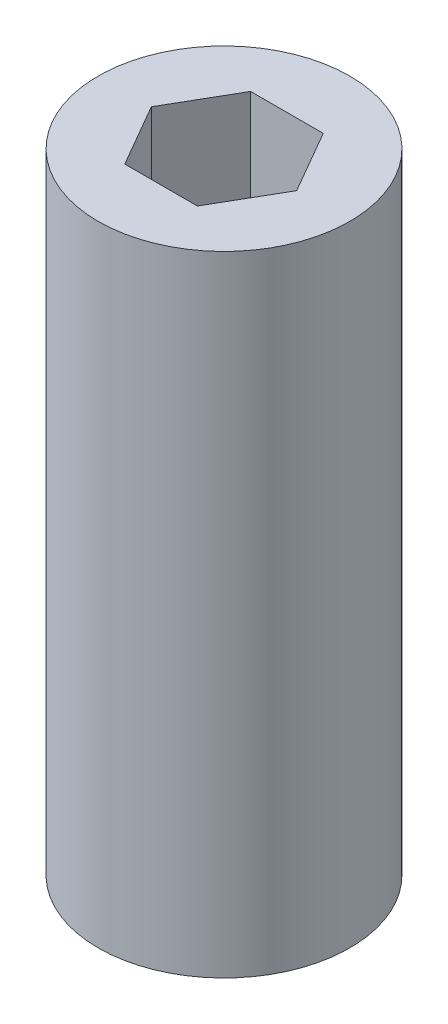
ISO-10303-21;
HEADER;
FILE_DESCRIPTION(('STEP AP214'),'2;1');
FILE_NAME('part.step','',(''),(''),'','','');
FILE_SCHEMA(('AUTOMOTIVE_DESIGN { 1 0 10303 214 1 1 1 1 }'));
ENDSEC;
DATA;
#1=APPLICATION_CONTEXT('core data for automotive mechanical design processes');
#2=APPLICATION_PROTOCOL_DEFINITION('international standard','automotive_design',2000,#1);
#3=PRODUCT_CONTEXT('',#1,'mechanical');
#4=PRODUCT('Part','Part','',(#3));
#5=PRODUCT_RELATED_PRODUCT_CATEGORY('part','',(#4));
#6=PRODUCT_DEFINITION_FORMATION('','',#4);
#7=PRODUCT_DEFINITION_CONTEXT('part definition',#1,'design');
#8=PRODUCT_DEFINITION('design','',#6,#7);
#9=PRODUCT_DEFINITION_SHAPE('','',#8);
#10=(LENGTH_UNIT() NAMED_UNIT(*) SI_UNIT(.MILLI.,.METRE.));
#11=(NAMED_UNIT(*) PLANE_ANGLE_UNIT() SI_UNIT($,.RADIAN.));
#12=(NAMED_UNIT(*) SI_UNIT($,.STERADIAN.) SOLID_ANGLE_UNIT());
#13=UNCERTAINTY_MEASURE_WITH_UNIT(LENGTH_MEASURE(1.E-05),#10,'distance_accuracy_value','');
#14=(GEOMETRIC_REPRESENTATION_CONTEXT(3) GLOBAL_UNCERTAINTY_ASSIGNED_CONTEXT((#13)) GLOBAL_UNIT_ASSIGNED_CONTEXT((#10,
#11,#12)) REPRESENTATION_CONTEXT('',''));
#15=CARTESIAN_POINT('',(0.,0.,0.));
#16=DIRECTION('',(0.,0.,1.));
#17=DIRECTION('',(1.,0.,0.));
#18=AXIS2_PLACEMENT_3D('',#15,#16,#17);
#19=CARTESIAN_POINT('',(0.,8.3,7.));
#20=DIRECTION('',(0.,1.,0.));
#21=DIRECTION('',(0.,0.,1.));
#22=AXIS2_PLACEMENT_3D('',#19,#20,#21);
#23=PLANE('',#22);
#24=DIRECTION('',(-0.49999999836129,0.,-0.866025404730548));
#25=VECTOR('',#24,1.);
#26=CARTESIAN_POINT('',(0.64951905,8.3,6.625));
#27=LINE('',#26,#25);
#28=CARTESIAN_POINT('',(0.8660254,8.3,7.));
#29=VERTEX_POINT('',#28);
#30=CARTESIAN_POINT('',(0.4330127,8.3,6.25));
#31=VERTEX_POINT('',#30);
#32=EDGE_CURVE('E80',#29,#31,#27,.T.);
#33=ORIENTED_EDGE('',*,*,#32,.T.);
#34=DIRECTION('',(-1.,0.,0.));
#35=VECTOR('',#34,1.);
#36=CARTESIAN_POINT('',(0.,8.3,6.25));
#37=LINE('',#36,#35);
#38=CARTESIAN_POINT('',(-0.4330127,8.3,6.25));
#39=VERTEX_POINT('',#38);
#40=EDGE_CURVE('E64',#31,#39,#37,.T.);
#41=ORIENTED_EDGE('',*,*,#40,.T.);
#42=DIRECTION('',(-0.49999999836129,0.,0.866025404730548));
#43=VECTOR('',#42,1.);
#44=CARTESIAN_POINT('',(-0.64951905,8.3,6.625));
#45=LINE('',#44,#43);
#46=CARTESIAN_POINT('',(-0.8660254,8.3,7.));
#47=VERTEX_POINT('',#46);
#48=EDGE_CURVE('E69',#39,#47,#45,.T.);
#49=ORIENTED_EDGE('',*,*,#48,.T.);
#50=DIRECTION('',(0.49999999836129,0.,0.866025404730548));
#51=VECTOR('',#50,1.);
#52=CARTESIAN_POINT('',(-0.64951905,8.3,7.375));
#53=LINE('',#52,#51);
#54=CARTESIAN_POINT('',(-0.4330127,8.3,7.75));
#55=VERTEX_POINT('',#54);
#56=EDGE_CURVE('E103',#47,#55,#53,.T.);
#57=ORIENTED_EDGE('',*,*,#56,.T.);
#58=DIRECTION('',(1.,0.,0.));
#59=VECTOR('',#58,1.);
#60=CARTESIAN_POINT('',(0.,8.3,7.75));
#61=LINE('',#60,#59);
#62=CARTESIAN_POINT('',(0.4330127,8.3,7.75));
#63=VERTEX_POINT('',#62);
#64=EDGE_CURVE('E98',#55,#63,#61,.T.);
#65=ORIENTED_EDGE('',*,*,#64,.T.);
#66=DIRECTION('',(0.49999999836129,0.,-0.866025404730548));
#67=VECTOR('',#66,1.);
#68=CARTESIAN_POINT('',(0.64951905,8.3,7.375));
#69=LINE('',#68,#67);
#70=EDGE_CURVE('E94',#63,#29,#69,.T.);
#71=ORIENTED_EDGE('',*,*,#70,.T.);
#72=EDGE_LOOP('',(#33,#41,#49,#57,#65,#71));
#73=FACE_BOUND('',#72,.T.);
#74=ADVANCED_FACE('F16',(#73),#23,.T.);
#75=CARTESIAN_POINT('',(-0.64951905,10.,6.625));
#76=DIRECTION('',(-0.866025404730548,0.,-0.49999999836129));
#77=DIRECTION('',(-0.49999999836129,0.,0.866025404730548));
#78=AXIS2_PLACEMENT_3D('',#75,#76,#77);
#79=PLANE('',#78);
#80=DIRECTION('',(0.,1.,0.));
#81=VECTOR('',#80,1.);
#82=CARTESIAN_POINT('',(-0.4330127,10.,6.25));
#83=LINE('',#82,#81);
#84=CARTESIAN_POINT('',(-0.4330127,10.,6.25));
#85=VERTEX_POINT('',#84);
#86=EDGE_CURVE('E71',#39,#85,#83,.T.);
#87=ORIENTED_EDGE('',*,*,#86,.T.);
#88=DIRECTION('',(0.49999999836129,0.,-0.866025404730548));
#89=VECTOR('',#88,1.);
#90=CARTESIAN_POINT('',(-0.8660254,10.,7.));
#91=LINE('',#90,#89);
#92=CARTESIAN_POINT('',(-0.8660254,10.,7.));
#93=VERTEX_POINT('',#92);
#94=EDGE_CURVE('E105',#93,#85,#91,.T.);
#95=ORIENTED_EDGE('',*,*,#94,.F.);
#96=DIRECTION('',(0.,1.,0.));
#97=VECTOR('',#96,1.);
#98=CARTESIAN_POINT('',(-0.8660254,10.,7.));
#99=LINE('',#98,#97);
#100=EDGE_CURVE('E74',#93,#47,#99,.F.);
#101=ORIENTED_EDGE('',*,*,#100,.T.);
#102=ORIENTED_EDGE('',*,*,#48,.F.);
#103=EDGE_LOOP('',(#87,#95,#101,#102));
#104=FACE_BOUND('',#103,.T.);
#105=ADVANCED_FACE('F70',(#104),#79,.F.);
#106=CARTESIAN_POINT('',(0.,10.,6.25));
#107=DIRECTION('',(0.,0.,-1.));
#108=DIRECTION('',(-1.,0.,0.));
#109=AXIS2_PLACEMENT_3D('',#106,#107,#108);
#110=PLANE('',#109);
#111=DIRECTION('',(0.,1.,0.));
#112=VECTOR('',#111,1.);
#113=CARTESIAN_POINT('',(0.4330127,10.,6.25));
#114=LINE('',#113,#112);
#115=CARTESIAN_POINT('',(0.4330127,10.,6.25));
#116=VERTEX_POINT('',#115);
#117=EDGE_CURVE('E82',#31,#116,#114,.T.);
#118=ORIENTED_EDGE('',*,*,#117,.T.);
#119=DIRECTION('',(1.,0.,0.));
#120=VECTOR('',#119,1.);
#121=CARTESIAN_POINT('',(0.,10.,6.25));
#122=LINE('',#121,#120);
#123=EDGE_CURVE('E86',#85,#116,#122,.T.);
#124=ORIENTED_EDGE('',*,*,#123,.F.);
#125=ORIENTED_EDGE('',*,*,#86,.F.);
#126=ORIENTED_EDGE('',*,*,#40,.F.);
#127=EDGE_LOOP('',(#118,#124,#125,#126));
#128=FACE_BOUND('',#127,.T.);
#129=ADVANCED_FACE('F84',(#128),#110,.F.);
#130=CARTESIAN_POINT('',(0.64951905,10.,6.625));
#131=DIRECTION('',(0.866025404730548,0.,-0.49999999836129));
#132=DIRECTION('',(-0.49999999836129,0.,-0.866025404730548));
#133=AXIS2_PLACEMENT_3D('',#130,#131,#132);
#134=PLANE('',#133);
#135=DIRECTION('',(0.,1.,0.));
#136=VECTOR('',#135,1.);
#137=CARTESIAN_POINT('',(0.8660254,10.,7.));
#138=LINE('',#137,#136);
#139=CARTESIAN_POINT('',(0.8660254,10.,7.));
#140=VERTEX_POINT('',#139);
#141=EDGE_CURVE('E92',#29,#140,#138,.T.);
#142=ORIENTED_EDGE('',*,*,#141,.T.);
#143=DIRECTION('',(0.49999999836129,0.,0.866025404730548));
#144=VECTOR('',#143,1.);
#145=CARTESIAN_POINT('',(0.4330127,10.,6.25));
#146=LINE('',#145,#144);
#147=EDGE_CURVE('E108',#116,#140,#146,.T.);
#148=ORIENTED_EDGE('',*,*,#147,.F.);
#149=ORIENTED_EDGE('',*,*,#117,.F.);
#150=ORIENTED_EDGE('',*,*,#32,.F.);
#151=EDGE_LOOP('',(#142,#148,#149,#150));
#152=FACE_BOUND('',#151,.T.);
#153=ADVANCED_FACE('F193',(#152),#134,.F.);
#154=CARTESIAN_POINT('',(0.64951905,10.,7.375));
#155=DIRECTION('',(0.866025404730548,0.,0.49999999836129));
#156=DIRECTION('',(0.49999999836129,0.,-0.866025404730548));
#157=AXIS2_PLACEMENT_3D('',#154,#155,#156);
#158=PLANE('',#157);
#159=DIRECTION('',(0.,1.,0.));
#160=VECTOR('',#159,1.);
#161=CARTESIAN_POINT('',(0.4330127,10.,7.75));
#162=LINE('',#161,#160);
#163=CARTESIAN_POINT('',(0.4330127,10.,7.75));
#164=VERTEX_POINT('',#163);
#165=EDGE_CURVE('E96',#63,#164,#162,.T.);
#166=ORIENTED_EDGE('',*,*,#165,.T.);
#167=DIRECTION('',(-0.49999999836129,0.,0.866025404730548));
#168=VECTOR('',#167,1.);
#169=CARTESIAN_POINT('',(0.8660254,10.,7.));
#170=LINE('',#169,#168);
#171=EDGE_CURVE('E111',#140,#164,#170,.T.);
#172=ORIENTED_EDGE('',*,*,#171,.F.);
#173=ORIENTED_EDGE('',*,*,#141,.F.);
#174=ORIENTED_EDGE('',*,*,#70,.F.);
#175=EDGE_LOOP('',(#166,#172,#173,#174));
#176=FACE_BOUND('',#175,.T.);
#177=ADVANCED_FACE('F135',(#176),#158,.F.);
#178=CARTESIAN_POINT('',(0.,10.,7.75));
#179=DIRECTION('',(0.,0.,1.));
#180=DIRECTION('',(1.,0.,0.));
#181=AXIS2_PLACEMENT_3D('',#178,#179,#180);
#182=PLANE('',#181);
#183=DIRECTION('',(0.,1.,0.));
#184=VECTOR('',#183,1.);
#185=CARTESIAN_POINT('',(-0.4330127,10.,7.75));
#186=LINE('',#185,#184);
#187=CARTESIAN_POINT('',(-0.4330127,10.,7.75));
#188=VERTEX_POINT('',#187);
#189=EDGE_CURVE('E32',#55,#188,#186,.T.);
#190=ORIENTED_EDGE('',*,*,#189,.T.);
#191=DIRECTION('',(1.,0.,0.));
#192=VECTOR('',#191,1.);
#193=CARTESIAN_POINT('',(0.,10.,7.75));
#194=LINE('',#193,#192);
#195=EDGE_CURVE('E114',#164,#188,#194,.F.);
#196=ORIENTED_EDGE('',*,*,#195,.F.);
#197=ORIENTED_EDGE('',*,*,#165,.F.);
#198=ORIENTED_EDGE('',*,*,#64,.F.);
#199=EDGE_LOOP('',(#190,#196,#197,#198));
#200=FACE_BOUND('',#199,.T.);
#201=ADVANCED_FACE('F133',(#200),#182,.F.);
#202=CARTESIAN_POINT('',(-0.64951905,10.,7.375));
#203=DIRECTION('',(-0.866025404730548,0.,0.49999999836129));
#204=DIRECTION('',(0.49999999836129,0.,0.866025404730548));
#205=AXIS2_PLACEMENT_3D('',#202,#203,#204);
#206=PLANE('',#205);
#207=ORIENTED_EDGE('',*,*,#100,.F.);
#208=DIRECTION('',(-0.49999999836129,0.,-0.866025404730548));
#209=VECTOR('',#208,1.);
#210=CARTESIAN_POINT('',(-0.4330127,10.,7.75));
#211=LINE('',#210,#209);
#212=EDGE_CURVE('E117',#188,#93,#211,.T.);
#213=ORIENTED_EDGE('',*,*,#212,.F.);
#214=ORIENTED_EDGE('',*,*,#189,.F.);
#215=ORIENTED_EDGE('',*,*,#56,.F.);
#216=EDGE_LOOP('',(#207,#213,#214,#215));
#217=FACE_BOUND('',#216,.T.);
#218=ADVANCED_FACE('F129',(#217),#206,.F.);
#219=CARTESIAN_POINT('',(0.,10.,6.25));
#220=DIRECTION('',(0.,1.,0.));
#221=DIRECTION('',(0.,0.,1.));
#222=AXIS2_PLACEMENT_3D('',#219,#220,#221);
#223=PLANE('',#222);
#224=CARTESIAN_POINT('',(0.,10.,7.));
#225=DIRECTION('',(0.,-1.,0.));
#226=DIRECTION('',(0.,0.,-1.));
#227=AXIS2_PLACEMENT_3D('',#224,#225,#226);
#228=CIRCLE('',#227,1.5);
#229=CARTESIAN_POINT('',(0.,10.,5.5));
#230=VERTEX_POINT('',#229);
#231=EDGE_CURVE('E19',#230,#230,#228,.T.);
#232=ORIENTED_EDGE('',*,*,#231,.F.);
#233=EDGE_LOOP('',(#232));
#234=FACE_BOUND('',#233,.T.);
#235=ORIENTED_EDGE('',*,*,#195,.T.);
#236=ORIENTED_EDGE('',*,*,#212,.T.);
#237=ORIENTED_EDGE('',*,*,#94,.T.);
#238=ORIENTED_EDGE('',*,*,#123,.T.);
#239=ORIENTED_EDGE('',*,*,#147,.T.);
#240=ORIENTED_EDGE('',*,*,#171,.T.);
#241=EDGE_LOOP('',(#235,#236,#237,#238,#239,#240));
#242=FACE_BOUND('',#241,.T.);
#243=ADVANCED_FACE('F126',(#234,#242),#223,.T.);
#244=CARTESIAN_POINT('',(0.,2.5,6.25));
#245=DIRECTION('',(0.,-1.,0.));
#246=DIRECTION('',(0.,0.,-1.));
#247=AXIS2_PLACEMENT_3D('',#244,#245,#246);
#248=PLANE('',#247);
#249=CARTESIAN_POINT('',(0.,2.5,7.));
#250=DIRECTION('',(0.,-1.,0.));
#251=DIRECTION('',(0.,0.,-1.));
#252=AXIS2_PLACEMENT_3D('',#249,#250,#251);
#253=CIRCLE('',#252,1.5);
#254=CARTESIAN_POINT('',(0.,2.5,5.5));
#255=VERTEX_POINT('',#254);
#256=EDGE_CURVE('E11',#255,#255,#253,.F.);
#257=ORIENTED_EDGE('',*,*,#256,.F.);
#258=EDGE_LOOP('',(#257));
#259=FACE_BOUND('',#258,.T.);
#260=ADVANCED_FACE('F128',(#259),#248,.T.);
#261=CARTESIAN_POINT('',(0.,6.25,7.));
#262=DIRECTION('',(0.,-1.,0.));
#263=DIRECTION('',(0.,0.,-1.));
#264=AXIS2_PLACEMENT_3D('',#261,#262,#263);
#265=CYLINDRICAL_SURFACE('',#264,1.5);
#266=ORIENTED_EDGE('',*,*,#231,.T.);
#267=EDGE_LOOP('',(#266));
#268=FACE_BOUND('',#267,.T.);
#269=ORIENTED_EDGE('',*,*,#256,.T.);
#270=EDGE_LOOP('',(#269));
#271=FACE_BOUND('',#270,.T.);
#272=ADVANCED_FACE('F123',(#268,#271),#265,.T.);
#273=CLOSED_SHELL('',(#74,#105,#129,#153,#177,#201,#218,#243,#260,#272));
#274=MANIFOLD_SOLID_BREP('B1',#273);
#275=ADVANCED_BREP_SHAPE_REPRESENTATION('',(#18,#274),#14);
#276=SHAPE_DEFINITION_REPRESENTATION(#9,#275);
ENDSEC;
END-ISO-10303-21;
